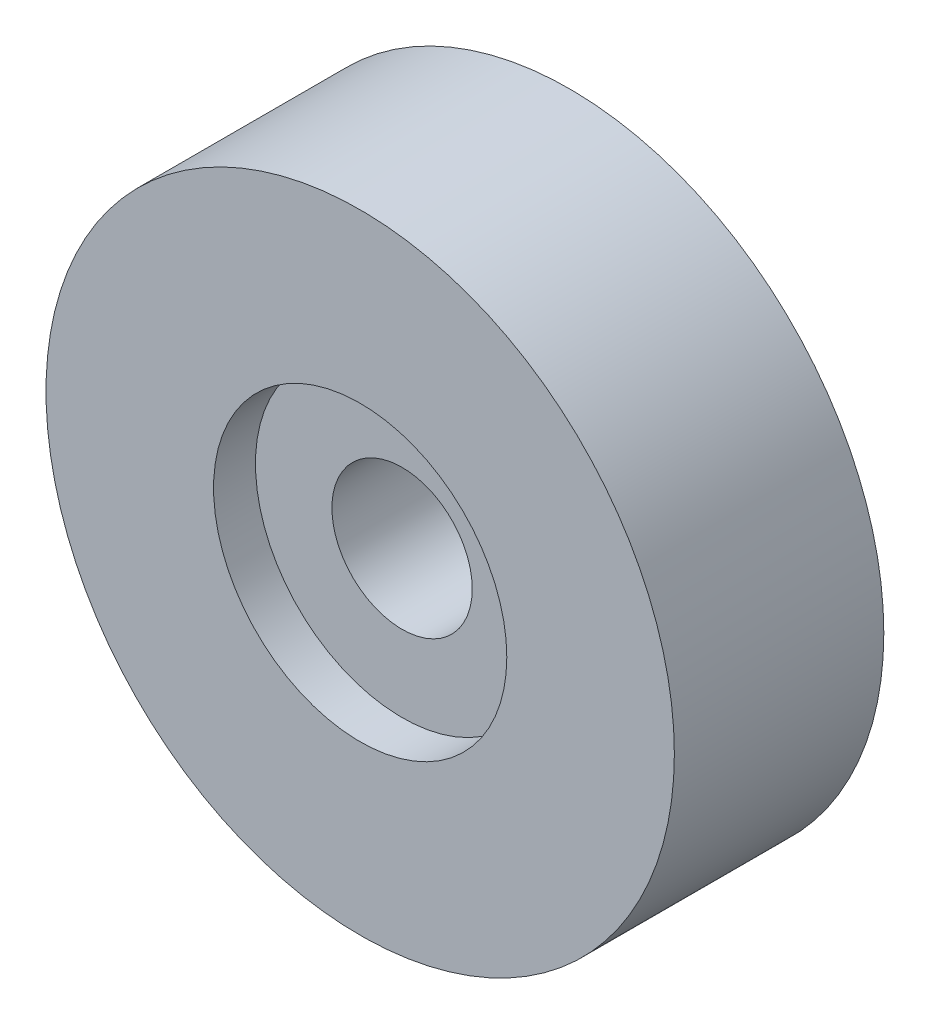
ISO-10303-21;
HEADER;
FILE_DESCRIPTION(('STEP AP214'),'2;1');
FILE_NAME('part.step','',(''),(''),'','','');
FILE_SCHEMA(('AUTOMOTIVE_DESIGN { 1 0 10303 214 1 1 1 1 }'));
ENDSEC;
DATA;
#1=APPLICATION_CONTEXT('core data for automotive mechanical design processes');
#2=APPLICATION_PROTOCOL_DEFINITION('international standard','automotive_design',2000,#1);
#3=PRODUCT_CONTEXT('',#1,'mechanical');
#4=PRODUCT('Part','Part','',(#3));
#5=PRODUCT_RELATED_PRODUCT_CATEGORY('part','',(#4));
#6=PRODUCT_DEFINITION_FORMATION('','',#4);
#7=PRODUCT_DEFINITION_CONTEXT('part definition',#1,'design');
#8=PRODUCT_DEFINITION('design','',#6,#7);
#9=PRODUCT_DEFINITION_SHAPE('','',#8);
#10=(LENGTH_UNIT() NAMED_UNIT(*) SI_UNIT(.MILLI.,.METRE.));
#11=(NAMED_UNIT(*) PLANE_ANGLE_UNIT() SI_UNIT($,.RADIAN.));
#12=(NAMED_UNIT(*) SI_UNIT($,.STERADIAN.) SOLID_ANGLE_UNIT());
#13=UNCERTAINTY_MEASURE_WITH_UNIT(LENGTH_MEASURE(1.E-05),#10,'distance_accuracy_value','');
#14=(GEOMETRIC_REPRESENTATION_CONTEXT(3) GLOBAL_UNCERTAINTY_ASSIGNED_CONTEXT((#13)) GLOBAL_UNIT_ASSIGNED_CONTEXT((#10,
#11,#12)) REPRESENTATION_CONTEXT('',''));
#15=CARTESIAN_POINT('',(0.,0.,0.));
#16=DIRECTION('',(0.,0.,1.));
#17=DIRECTION('',(1.,0.,0.));
#18=AXIS2_PLACEMENT_3D('',#15,#16,#17);
#19=CARTESIAN_POINT('',(0.,0.,10.));
#20=DIRECTION('',(0.,0.,-1.));
#21=DIRECTION('',(-1.,0.,0.));
#22=AXIS2_PLACEMENT_3D('',#19,#20,#21);
#23=CYLINDRICAL_SURFACE('',#22,3.35);
#24=CARTESIAN_POINT('',(0.,0.,0.));
#25=DIRECTION('',(0.,0.,1.));
#26=DIRECTION('',(1.,0.,0.));
#27=AXIS2_PLACEMENT_3D('',#24,#25,#26);
#28=CIRCLE('',#27,3.35);
#29=CARTESIAN_POINT('',(3.35,0.,0.));
#30=VERTEX_POINT('',#29);
#31=EDGE_CURVE('E44',#30,#30,#28,.T.);
#32=ORIENTED_EDGE('',*,*,#31,.F.);
#33=EDGE_LOOP('',(#32));
#34=FACE_BOUND('',#33,.T.);
#35=CARTESIAN_POINT('',(0.,0.,8.));
#36=DIRECTION('',(0.,0.,1.));
#37=DIRECTION('',(1.,0.,0.));
#38=AXIS2_PLACEMENT_3D('',#35,#36,#37);
#39=CIRCLE('',#38,3.35);
#40=CARTESIAN_POINT('',(3.35,0.,8.));
#41=VERTEX_POINT('',#40);
#42=EDGE_CURVE('E35',#41,#41,#39,.T.);
#43=ORIENTED_EDGE('',*,*,#42,.T.);
#44=EDGE_LOOP('',(#43));
#45=FACE_BOUND('',#44,.T.);
#46=ADVANCED_FACE('F31',(#34,#45),#23,.F.);
#47=CARTESIAN_POINT('',(0.,0.,10.));
#48=DIRECTION('',(0.,0.,1.));
#49=DIRECTION('',(1.,0.,0.));
#50=AXIS2_PLACEMENT_3D('',#47,#48,#49);
#51=PLANE('',#50);
#52=CARTESIAN_POINT('',(0.,0.,10.));
#53=DIRECTION('',(0.,0.,1.));
#54=DIRECTION('',(1.,0.,0.));
#55=AXIS2_PLACEMENT_3D('',#52,#53,#54);
#56=CIRCLE('',#55,7.);
#57=CARTESIAN_POINT('',(7.,0.,10.));
#58=VERTEX_POINT('',#57);
#59=EDGE_CURVE('E48',#58,#58,#56,.T.);
#60=ORIENTED_EDGE('',*,*,#59,.F.);
#61=EDGE_LOOP('',(#60));
#62=FACE_BOUND('',#61,.T.);
#63=CARTESIAN_POINT('',(0.,0.,10.));
#64=DIRECTION('',(0.,0.,1.));
#65=DIRECTION('',(1.,0.,0.));
#66=AXIS2_PLACEMENT_3D('',#63,#64,#65);
#67=CIRCLE('',#66,15.);
#68=CARTESIAN_POINT('',(15.,0.,10.));
#69=VERTEX_POINT('',#68);
#70=EDGE_CURVE('E10',#69,#69,#67,.T.);
#71=ORIENTED_EDGE('',*,*,#70,.T.);
#72=EDGE_LOOP('',(#71));
#73=FACE_BOUND('',#72,.T.);
#74=ADVANCED_FACE('F69',(#62,#73),#51,.T.);
#75=CARTESIAN_POINT('',(0.,0.,0.));
#76=DIRECTION('',(0.,0.,1.));
#77=DIRECTION('',(1.,0.,0.));
#78=AXIS2_PLACEMENT_3D('',#75,#76,#77);
#79=PLANE('',#78);
#80=CARTESIAN_POINT('',(0.,0.,0.));
#81=DIRECTION('',(0.,0.,1.));
#82=DIRECTION('',(1.,0.,0.));
#83=AXIS2_PLACEMENT_3D('',#80,#81,#82);
#84=CIRCLE('',#83,15.);
#85=CARTESIAN_POINT('',(15.,0.,0.));
#86=VERTEX_POINT('',#85);
#87=EDGE_CURVE('E39',#86,#86,#84,.T.);
#88=ORIENTED_EDGE('',*,*,#87,.F.);
#89=EDGE_LOOP('',(#88));
#90=FACE_BOUND('',#89,.T.);
#91=ORIENTED_EDGE('',*,*,#31,.T.);
#92=EDGE_LOOP('',(#91));
#93=FACE_BOUND('',#92,.T.);
#94=ADVANCED_FACE('F75',(#90,#93),#79,.F.);
#95=CARTESIAN_POINT('',(0.,0.,10.));
#96=DIRECTION('',(0.,0.,-1.));
#97=DIRECTION('',(-1.,0.,0.));
#98=AXIS2_PLACEMENT_3D('',#95,#96,#97);
#99=CYLINDRICAL_SURFACE('',#98,15.);
#100=ORIENTED_EDGE('',*,*,#70,.F.);
#101=EDGE_LOOP('',(#100));
#102=FACE_BOUND('',#101,.T.);
#103=ORIENTED_EDGE('',*,*,#87,.T.);
#104=EDGE_LOOP('',(#103));
#105=FACE_BOUND('',#104,.T.);
#106=ADVANCED_FACE('F33',(#102,#105),#99,.T.);
#107=CARTESIAN_POINT('',(0.,0.,8.));
#108=DIRECTION('',(0.,0.,1.));
#109=DIRECTION('',(1.,0.,0.));
#110=AXIS2_PLACEMENT_3D('',#107,#108,#109);
#111=CYLINDRICAL_SURFACE('',#110,7.);
#112=CARTESIAN_POINT('',(0.,0.,8.));
#113=DIRECTION('',(0.,0.,1.));
#114=DIRECTION('',(1.,0.,0.));
#115=AXIS2_PLACEMENT_3D('',#112,#113,#114);
#116=CIRCLE('',#115,7.);
#117=CARTESIAN_POINT('',(7.,0.,8.));
#118=VERTEX_POINT('',#117);
#119=EDGE_CURVE('E51',#118,#118,#116,.T.);
#120=ORIENTED_EDGE('',*,*,#119,.F.);
#121=EDGE_LOOP('',(#120));
#122=FACE_BOUND('',#121,.T.);
#123=ORIENTED_EDGE('',*,*,#59,.T.);
#124=EDGE_LOOP('',(#123));
#125=FACE_BOUND('',#124,.T.);
#126=ADVANCED_FACE('F61',(#122,#125),#111,.F.);
#127=CARTESIAN_POINT('',(0.,0.,8.));
#128=DIRECTION('',(0.,0.,1.));
#129=DIRECTION('',(1.,0.,0.));
#130=AXIS2_PLACEMENT_3D('',#127,#128,#129);
#131=PLANE('',#130);
#132=ORIENTED_EDGE('',*,*,#42,.F.);
#133=EDGE_LOOP('',(#132));
#134=FACE_BOUND('',#133,.T.);
#135=ORIENTED_EDGE('',*,*,#119,.T.);
#136=EDGE_LOOP('',(#135));
#137=FACE_BOUND('',#136,.T.);
#138=ADVANCED_FACE('F59',(#134,#137),#131,.T.);
#139=CLOSED_SHELL('',(#46,#74,#94,#106,#126,#138));
#140=MANIFOLD_SOLID_BREP('B2',#139);
#141=ADVANCED_BREP_SHAPE_REPRESENTATION('',(#18,#140),#14);
#142=SHAPE_DEFINITION_REPRESENTATION(#9,#141);
ENDSEC;
END-ISO-10303-21;
